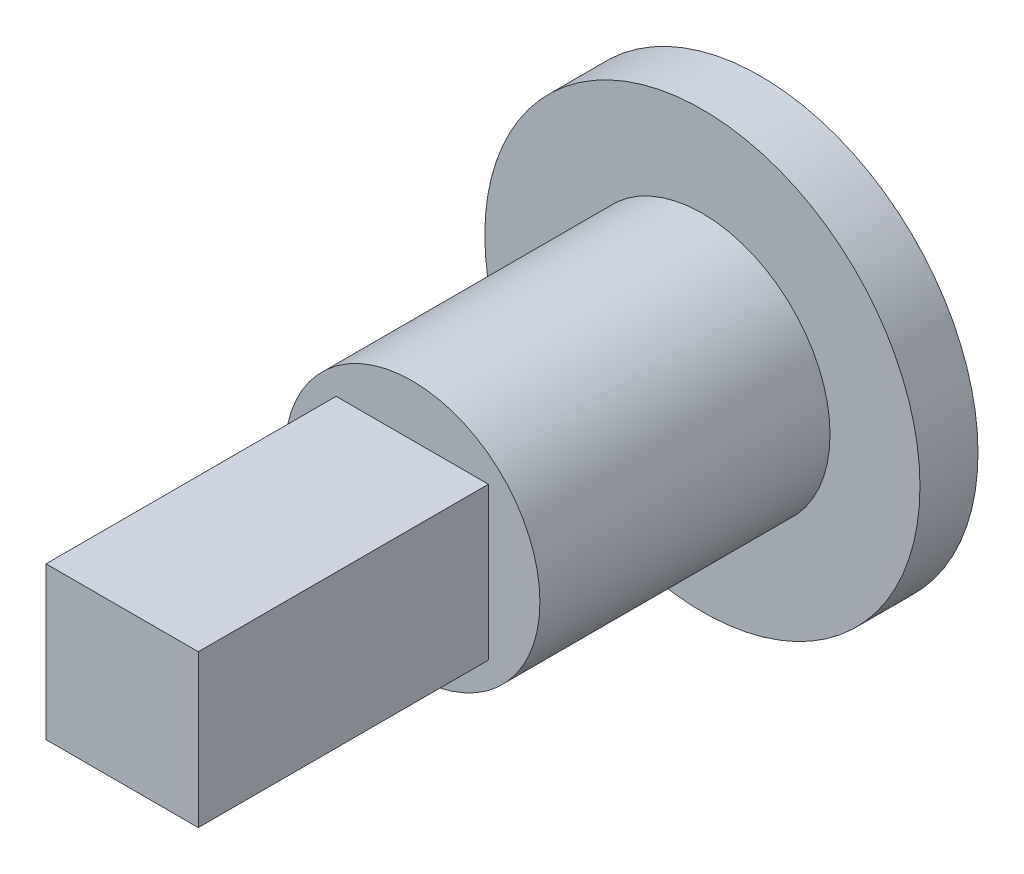
ISO-10303-21;
HEADER;
FILE_DESCRIPTION(('STEP AP214'),'2;1');
FILE_NAME('part.step','',(''),(''),'','','');
FILE_SCHEMA(('AUTOMOTIVE_DESIGN { 1 0 10303 214 1 1 1 1 }'));
ENDSEC;
DATA;
#1=APPLICATION_CONTEXT('core data for automotive mechanical design processes');
#2=APPLICATION_PROTOCOL_DEFINITION('international standard','automotive_design',2000,#1);
#3=PRODUCT_CONTEXT('',#1,'mechanical');
#4=PRODUCT('Part','Part','',(#3));
#5=PRODUCT_RELATED_PRODUCT_CATEGORY('part','',(#4));
#6=PRODUCT_DEFINITION_FORMATION('','',#4);
#7=PRODUCT_DEFINITION_CONTEXT('part definition',#1,'design');
#8=PRODUCT_DEFINITION('design','',#6,#7);
#9=PRODUCT_DEFINITION_SHAPE('','',#8);
#10=(LENGTH_UNIT() NAMED_UNIT(*) SI_UNIT(.MILLI.,.METRE.));
#11=(NAMED_UNIT(*) PLANE_ANGLE_UNIT() SI_UNIT($,.RADIAN.));
#12=(NAMED_UNIT(*) SI_UNIT($,.STERADIAN.) SOLID_ANGLE_UNIT());
#13=UNCERTAINTY_MEASURE_WITH_UNIT(LENGTH_MEASURE(1.E-05),#10,'distance_accuracy_value','');
#14=(GEOMETRIC_REPRESENTATION_CONTEXT(3) GLOBAL_UNCERTAINTY_ASSIGNED_CONTEXT((#13)) GLOBAL_UNIT_ASSIGNED_CONTEXT((#10,
#11,#12)) REPRESENTATION_CONTEXT('',''));
#15=CARTESIAN_POINT('',(0.,0.,0.));
#16=DIRECTION('',(0.,0.,1.));
#17=DIRECTION('',(1.,0.,0.));
#18=AXIS2_PLACEMENT_3D('',#15,#16,#17);
#19=CARTESIAN_POINT('',(0.,0.,10.));
#20=DIRECTION('',(0.,0.,-1.));
#21=DIRECTION('',(-1.,0.,0.));
#22=AXIS2_PLACEMENT_3D('',#19,#20,#21);
#23=CYLINDRICAL_SURFACE('',#22,4.4);
#24=CARTESIAN_POINT('',(0.,0.,10.));
#25=DIRECTION('',(0.,0.,1.));
#26=DIRECTION('',(1.,0.,0.));
#27=AXIS2_PLACEMENT_3D('',#24,#25,#26);
#28=CIRCLE('',#27,4.4);
#29=CARTESIAN_POINT('',(4.4,0.,10.));
#30=VERTEX_POINT('',#29);
#31=EDGE_CURVE('E11',#30,#30,#28,.T.);
#32=ORIENTED_EDGE('',*,*,#31,.F.);
#33=EDGE_LOOP('',(#32));
#34=FACE_BOUND('',#33,.T.);
#35=CARTESIAN_POINT('',(0.,0.,0.));
#36=DIRECTION('',(0.,0.,1.));
#37=DIRECTION('',(1.,0.,0.));
#38=AXIS2_PLACEMENT_3D('',#35,#36,#37);
#39=CIRCLE('',#38,4.4);
#40=CARTESIAN_POINT('',(4.4,0.,0.));
#41=VERTEX_POINT('',#40);
#42=EDGE_CURVE('E42',#41,#41,#39,.T.);
#43=ORIENTED_EDGE('',*,*,#42,.T.);
#44=EDGE_LOOP('',(#43));
#45=FACE_BOUND('',#44,.T.);
#46=ADVANCED_FACE('F39',(#34,#45),#23,.T.);
#47=CARTESIAN_POINT('',(0.,0.,10.));
#48=DIRECTION('',(0.,0.,1.));
#49=DIRECTION('',(1.,0.,0.));
#50=AXIS2_PLACEMENT_3D('',#47,#48,#49);
#51=PLANE('',#50);
#52=DIRECTION('',(0.,-1.,0.));
#53=VECTOR('',#52,1.);
#54=CARTESIAN_POINT('',(-2.625,2.625,10.));
#55=LINE('',#54,#53);
#56=CARTESIAN_POINT('',(-2.625,2.625,10.));
#57=VERTEX_POINT('',#56);
#58=CARTESIAN_POINT('',(-2.625,-2.625,10.));
#59=VERTEX_POINT('',#58);
#60=EDGE_CURVE('E55',#57,#59,#55,.T.);
#61=ORIENTED_EDGE('',*,*,#60,.F.);
#62=DIRECTION('',(-1.,0.,0.));
#63=VECTOR('',#62,1.);
#64=CARTESIAN_POINT('',(-2.625,2.625,10.));
#65=LINE('',#64,#63);
#66=CARTESIAN_POINT('',(2.625,2.625,10.));
#67=VERTEX_POINT('',#66);
#68=EDGE_CURVE('E59',#67,#57,#65,.T.);
#69=ORIENTED_EDGE('',*,*,#68,.F.);
#70=DIRECTION('',(0.,1.,0.));
#71=VECTOR('',#70,1.);
#72=CARTESIAN_POINT('',(2.625,2.625,10.));
#73=LINE('',#72,#71);
#74=CARTESIAN_POINT('',(2.625,-2.625,10.));
#75=VERTEX_POINT('',#74);
#76=EDGE_CURVE('E116',#75,#67,#73,.T.);
#77=ORIENTED_EDGE('',*,*,#76,.F.);
#78=DIRECTION('',(1.,0.,0.));
#79=VECTOR('',#78,1.);
#80=CARTESIAN_POINT('',(-2.625,-2.625,10.));
#81=LINE('',#80,#79);
#82=EDGE_CURVE('E119',#59,#75,#81,.T.);
#83=ORIENTED_EDGE('',*,*,#82,.F.);
#84=EDGE_LOOP('',(#61,#69,#77,#83));
#85=FACE_BOUND('',#84,.T.);
#86=ORIENTED_EDGE('',*,*,#31,.T.);
#87=EDGE_LOOP('',(#86));
#88=FACE_BOUND('',#87,.T.);
#89=ADVANCED_FACE('F161',(#85,#88),#51,.T.);
#90=CARTESIAN_POINT('',(-2.625,2.625,20.));
#91=DIRECTION('',(1.,0.,0.));
#92=DIRECTION('',(0.,1.,0.));
#93=AXIS2_PLACEMENT_3D('',#90,#91,#92);
#94=PLANE('',#93);
#95=ORIENTED_EDGE('',*,*,#60,.T.);
#96=DIRECTION('',(0.,0.,-1.));
#97=VECTOR('',#96,1.);
#98=CARTESIAN_POINT('',(-2.625,-2.625,20.));
#99=LINE('',#98,#97);
#100=CARTESIAN_POINT('',(-2.625,-2.625,20.));
#101=VERTEX_POINT('',#100);
#102=EDGE_CURVE('E48',#101,#59,#99,.T.);
#103=ORIENTED_EDGE('',*,*,#102,.F.);
#104=DIRECTION('',(0.,-1.,0.));
#105=VECTOR('',#104,1.);
#106=CARTESIAN_POINT('',(-2.625,2.625,20.));
#107=LINE('',#106,#105);
#108=CARTESIAN_POINT('',(-2.625,2.625,20.));
#109=VERTEX_POINT('',#108);
#110=EDGE_CURVE('E90',#109,#101,#107,.T.);
#111=ORIENTED_EDGE('',*,*,#110,.F.);
#112=DIRECTION('',(0.,0.,-1.));
#113=VECTOR('',#112,1.);
#114=CARTESIAN_POINT('',(-2.625,2.625,20.));
#115=LINE('',#114,#113);
#116=EDGE_CURVE('E111',#109,#57,#115,.T.);
#117=ORIENTED_EDGE('',*,*,#116,.T.);
#118=EDGE_LOOP('',(#95,#103,#111,#117));
#119=FACE_BOUND('',#118,.T.);
#120=ADVANCED_FACE('F101',(#119),#94,.F.);
#121=CARTESIAN_POINT('',(-2.625,-2.625,20.));
#122=DIRECTION('',(0.,1.,0.));
#123=DIRECTION('',(0.,0.,1.));
#124=AXIS2_PLACEMENT_3D('',#121,#122,#123);
#125=PLANE('',#124);
#126=ORIENTED_EDGE('',*,*,#82,.T.);
#127=DIRECTION('',(0.,0.,-1.));
#128=VECTOR('',#127,1.);
#129=CARTESIAN_POINT('',(2.625,-2.625,20.));
#130=LINE('',#129,#128);
#131=CARTESIAN_POINT('',(2.625,-2.625,20.));
#132=VERTEX_POINT('',#131);
#133=EDGE_CURVE('E85',#132,#75,#130,.T.);
#134=ORIENTED_EDGE('',*,*,#133,.F.);
#135=DIRECTION('',(1.,0.,0.));
#136=VECTOR('',#135,1.);
#137=CARTESIAN_POINT('',(-2.625,-2.625,20.));
#138=LINE('',#137,#136);
#139=EDGE_CURVE('E79',#101,#132,#138,.T.);
#140=ORIENTED_EDGE('',*,*,#139,.F.);
#141=ORIENTED_EDGE('',*,*,#102,.T.);
#142=EDGE_LOOP('',(#126,#134,#140,#141));
#143=FACE_BOUND('',#142,.T.);
#144=ADVANCED_FACE('F82',(#143),#125,.F.);
#145=CARTESIAN_POINT('',(2.625,2.625,20.));
#146=DIRECTION('',(-1.,0.,0.));
#147=DIRECTION('',(0.,-1.,0.));
#148=AXIS2_PLACEMENT_3D('',#145,#146,#147);
#149=PLANE('',#148);
#150=ORIENTED_EDGE('',*,*,#76,.T.);
#151=DIRECTION('',(0.,0.,-1.));
#152=VECTOR('',#151,1.);
#153=CARTESIAN_POINT('',(2.625,2.625,20.));
#154=LINE('',#153,#152);
#155=CARTESIAN_POINT('',(2.625,2.625,20.));
#156=VERTEX_POINT('',#155);
#157=EDGE_CURVE('E105',#156,#67,#154,.T.);
#158=ORIENTED_EDGE('',*,*,#157,.F.);
#159=DIRECTION('',(0.,1.,0.));
#160=VECTOR('',#159,1.);
#161=CARTESIAN_POINT('',(2.625,2.625,20.));
#162=LINE('',#161,#160);
#163=EDGE_CURVE('E89',#132,#156,#162,.T.);
#164=ORIENTED_EDGE('',*,*,#163,.F.);
#165=ORIENTED_EDGE('',*,*,#133,.T.);
#166=EDGE_LOOP('',(#150,#158,#164,#165));
#167=FACE_BOUND('',#166,.T.);
#168=ADVANCED_FACE('F175',(#167),#149,.F.);
#169=CARTESIAN_POINT('',(-2.625,2.625,20.));
#170=DIRECTION('',(0.,-1.,0.));
#171=DIRECTION('',(0.,0.,-1.));
#172=AXIS2_PLACEMENT_3D('',#169,#170,#171);
#173=PLANE('',#172);
#174=ORIENTED_EDGE('',*,*,#68,.T.);
#175=ORIENTED_EDGE('',*,*,#116,.F.);
#176=DIRECTION('',(-1.,0.,0.));
#177=VECTOR('',#176,1.);
#178=CARTESIAN_POINT('',(-2.625,2.625,20.));
#179=LINE('',#178,#177);
#180=EDGE_CURVE('E95',#156,#109,#179,.T.);
#181=ORIENTED_EDGE('',*,*,#180,.F.);
#182=ORIENTED_EDGE('',*,*,#157,.T.);
#183=EDGE_LOOP('',(#174,#175,#181,#182));
#184=FACE_BOUND('',#183,.T.);
#185=ADVANCED_FACE('F158',(#184),#173,.F.);
#186=CARTESIAN_POINT('',(0.,0.,20.));
#187=DIRECTION('',(0.,0.,1.));
#188=DIRECTION('',(1.,0.,0.));
#189=AXIS2_PLACEMENT_3D('',#186,#187,#188);
#190=PLANE('',#189);
#191=ORIENTED_EDGE('',*,*,#110,.T.);
#192=ORIENTED_EDGE('',*,*,#139,.T.);
#193=ORIENTED_EDGE('',*,*,#163,.T.);
#194=ORIENTED_EDGE('',*,*,#180,.T.);
#195=EDGE_LOOP('',(#191,#192,#193,#194));
#196=FACE_BOUND('',#195,.T.);
#197=ADVANCED_FACE('F93',(#196),#190,.T.);
#198=CARTESIAN_POINT('',(0.,0.,-2.));
#199=DIRECTION('',(0.,0.,1.));
#200=DIRECTION('',(1.,0.,0.));
#201=AXIS2_PLACEMENT_3D('',#198,#199,#200);
#202=CYLINDRICAL_SURFACE('',#201,7.5);
#203=CARTESIAN_POINT('',(0.,0.,-2.));
#204=DIRECTION('',(0.,0.,-1.));
#205=DIRECTION('',(-1.,0.,0.));
#206=AXIS2_PLACEMENT_3D('',#203,#204,#205);
#207=CIRCLE('',#206,7.5);
#208=CARTESIAN_POINT('',(-7.5,0.,-2.));
#209=VERTEX_POINT('',#208);
#210=EDGE_CURVE('E132',#209,#209,#207,.T.);
#211=ORIENTED_EDGE('',*,*,#210,.F.);
#212=EDGE_LOOP('',(#211));
#213=FACE_BOUND('',#212,.T.);
#214=CARTESIAN_POINT('',(0.,0.,0.));
#215=DIRECTION('',(0.,0.,-1.));
#216=DIRECTION('',(-1.,0.,0.));
#217=AXIS2_PLACEMENT_3D('',#214,#215,#216);
#218=CIRCLE('',#217,7.5);
#219=CARTESIAN_POINT('',(-7.5,0.,0.));
#220=VERTEX_POINT('',#219);
#221=EDGE_CURVE('E128',#220,#220,#218,.T.);
#222=ORIENTED_EDGE('',*,*,#221,.T.);
#223=EDGE_LOOP('',(#222));
#224=FACE_BOUND('',#223,.T.);
#225=ADVANCED_FACE('F149',(#213,#224),#202,.T.);
#226=CARTESIAN_POINT('',(0.,0.,-2.));
#227=DIRECTION('',(0.,0.,-1.));
#228=DIRECTION('',(-1.,0.,0.));
#229=AXIS2_PLACEMENT_3D('',#226,#227,#228);
#230=PLANE('',#229);
#231=ORIENTED_EDGE('',*,*,#210,.T.);
#232=EDGE_LOOP('',(#231));
#233=FACE_BOUND('',#232,.T.);
#234=ADVANCED_FACE('F145',(#233),#230,.T.);
#235=CARTESIAN_POINT('',(0.,0.,0.));
#236=DIRECTION('',(0.,0.,-1.));
#237=DIRECTION('',(-1.,0.,0.));
#238=AXIS2_PLACEMENT_3D('',#235,#236,#237);
#239=PLANE('',#238);
#240=ORIENTED_EDGE('',*,*,#42,.F.);
#241=EDGE_LOOP('',(#240));
#242=FACE_BOUND('',#241,.T.);
#243=ORIENTED_EDGE('',*,*,#221,.F.);
#244=EDGE_LOOP('',(#243));
#245=FACE_BOUND('',#244,.T.);
#246=ADVANCED_FACE('F142',(#242,#245),#239,.F.);
#247=CLOSED_SHELL('',(#46,#89,#120,#144,#168,#185,#197,#225,#234,#246));
#248=MANIFOLD_SOLID_BREP('B2',#247);
#249=ADVANCED_BREP_SHAPE_REPRESENTATION('',(#18,#248),#14);
#250=SHAPE_DEFINITION_REPRESENTATION(#9,#249);
ENDSEC;
END-ISO-10303-21;
